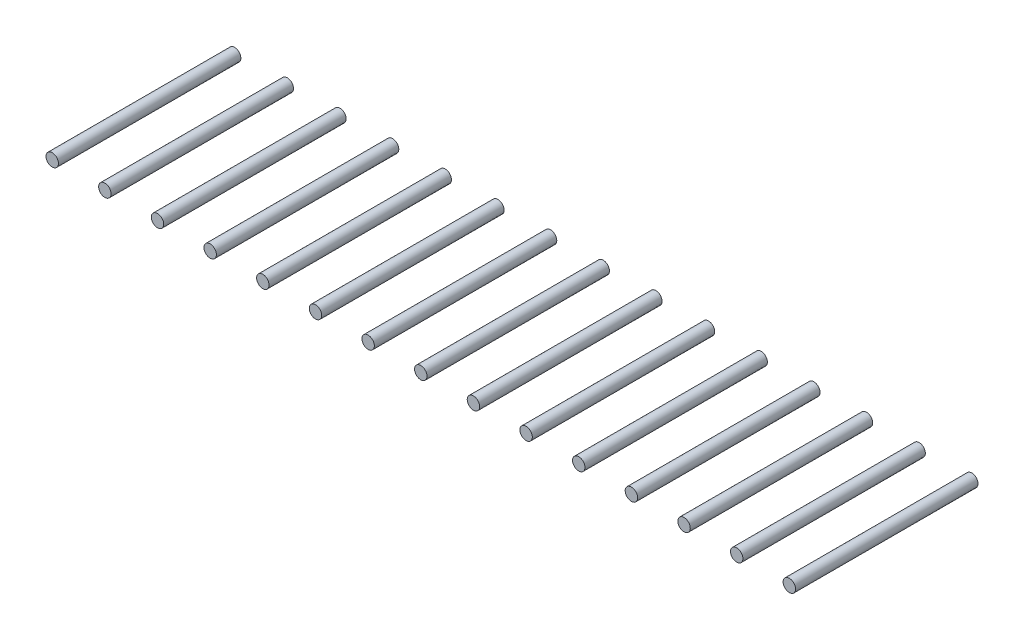
ISO-10303-21;
HEADER;
FILE_DESCRIPTION(('STEP AP214'),'2;1');
FILE_NAME('part.step','',(''),(''),'','','');
FILE_SCHEMA(('AUTOMOTIVE_DESIGN { 1 0 10303 214 1 1 1 1 }'));
ENDSEC;
DATA;
#1=APPLICATION_CONTEXT('core data for automotive mechanical design processes');
#2=APPLICATION_PROTOCOL_DEFINITION('international standard','automotive_design',2000,#1);
#3=PRODUCT_CONTEXT('',#1,'mechanical');
#4=PRODUCT('Part','Part','',(#3));
#5=PRODUCT_RELATED_PRODUCT_CATEGORY('part','',(#4));
#6=PRODUCT_DEFINITION_FORMATION('','',#4);
#7=PRODUCT_DEFINITION_CONTEXT('part definition',#1,'design');
#8=PRODUCT_DEFINITION('design','',#6,#7);
#9=PRODUCT_DEFINITION_SHAPE('','',#8);
#10=(LENGTH_UNIT() NAMED_UNIT(*) SI_UNIT(.MILLI.,.METRE.));
#11=(NAMED_UNIT(*) PLANE_ANGLE_UNIT() SI_UNIT($,.RADIAN.));
#12=(NAMED_UNIT(*) SI_UNIT($,.STERADIAN.) SOLID_ANGLE_UNIT());
#13=UNCERTAINTY_MEASURE_WITH_UNIT(LENGTH_MEASURE(1.E-05),#10,'distance_accuracy_value','');
#14=(GEOMETRIC_REPRESENTATION_CONTEXT(3) GLOBAL_UNCERTAINTY_ASSIGNED_CONTEXT((#13)) GLOBAL_UNIT_ASSIGNED_CONTEXT((#10,
#11,#12)) REPRESENTATION_CONTEXT('',''));
#15=CARTESIAN_POINT('',(0.,0.,0.));
#16=DIRECTION('',(0.,0.,1.));
#17=DIRECTION('',(1.,0.,0.));
#18=AXIS2_PLACEMENT_3D('',#15,#16,#17);
#19=CARTESIAN_POINT('',(35.56,0.,8.8));
#20=DIRECTION('',(0.,0.,-1.));
#21=DIRECTION('',(-1.,0.,0.));
#22=AXIS2_PLACEMENT_3D('',#19,#20,#21);
#23=CYLINDRICAL_SURFACE('',#22,0.299999999999997);
#24=CARTESIAN_POINT('',(35.56,0.,8.8));
#25=DIRECTION('',(0.,0.,1.));
#26=DIRECTION('',(1.,0.,0.));
#27=AXIS2_PLACEMENT_3D('',#24,#25,#26);
#28=CIRCLE('',#27,0.299999999999997);
#29=CARTESIAN_POINT('',(35.86,0.,8.8));
#30=VERTEX_POINT('',#29);
#31=EDGE_CURVE('E54',#30,#30,#28,.T.);
#32=ORIENTED_EDGE('',*,*,#31,.F.);
#33=EDGE_LOOP('',(#32));
#34=FACE_BOUND('',#33,.T.);
#35=CARTESIAN_POINT('',(35.56,0.,0.));
#36=DIRECTION('',(0.,0.,1.));
#37=DIRECTION('',(1.,0.,0.));
#38=AXIS2_PLACEMENT_3D('',#35,#36,#37);
#39=CIRCLE('',#38,0.299999999999997);
#40=CARTESIAN_POINT('',(35.86,0.,0.));
#41=VERTEX_POINT('',#40);
#42=EDGE_CURVE('E11',#41,#41,#39,.T.);
#43=ORIENTED_EDGE('',*,*,#42,.T.);
#44=EDGE_LOOP('',(#43));
#45=FACE_BOUND('',#44,.T.);
#46=ADVANCED_FACE('F50',(#34,#45),#23,.T.);
#47=CARTESIAN_POINT('',(35.56,0.,8.8));
#48=DIRECTION('',(0.,0.,1.));
#49=DIRECTION('',(1.,0.,0.));
#50=AXIS2_PLACEMENT_3D('',#47,#48,#49);
#51=PLANE('',#50);
#52=ORIENTED_EDGE('',*,*,#31,.T.);
#53=EDGE_LOOP('',(#52));
#54=FACE_BOUND('',#53,.T.);
#55=ADVANCED_FACE('F52',(#54),#51,.T.);
#56=CARTESIAN_POINT('',(35.56,0.,0.));
#57=DIRECTION('',(0.,0.,1.));
#58=DIRECTION('',(1.,0.,0.));
#59=AXIS2_PLACEMENT_3D('',#56,#57,#58);
#60=PLANE('',#59);
#61=ORIENTED_EDGE('',*,*,#42,.F.);
#62=EDGE_LOOP('',(#61));
#63=FACE_BOUND('',#62,.T.);
#64=ADVANCED_FACE('F69',(#63),#60,.F.);
#65=CLOSED_SHELL('',(#46,#55,#64));
#66=MANIFOLD_SOLID_BREP('B2',#65);
#67=CARTESIAN_POINT('',(33.02,0.,8.8));
#68=DIRECTION('',(0.,0.,-1.));
#69=DIRECTION('',(-1.,0.,0.));
#70=AXIS2_PLACEMENT_3D('',#67,#68,#69);
#71=CYLINDRICAL_SURFACE('',#70,0.299999999999997);
#72=CARTESIAN_POINT('',(33.02,0.,8.8));
#73=DIRECTION('',(0.,0.,1.));
#74=DIRECTION('',(1.,0.,0.));
#75=AXIS2_PLACEMENT_3D('',#72,#73,#74);
#76=CIRCLE('',#75,0.299999999999997);
#77=CARTESIAN_POINT('',(33.32,0.,8.8));
#78=VERTEX_POINT('',#77);
#79=EDGE_CURVE('E109',#78,#78,#76,.T.);
#80=ORIENTED_EDGE('',*,*,#79,.F.);
#81=EDGE_LOOP('',(#80));
#82=FACE_BOUND('',#81,.T.);
#83=CARTESIAN_POINT('',(33.02,0.,0.));
#84=DIRECTION('',(0.,0.,1.));
#85=DIRECTION('',(1.,0.,0.));
#86=AXIS2_PLACEMENT_3D('',#83,#84,#85);
#87=CIRCLE('',#86,0.299999999999997);
#88=CARTESIAN_POINT('',(33.32,0.,0.));
#89=VERTEX_POINT('',#88);
#90=EDGE_CURVE('E49',#89,#89,#87,.T.);
#91=ORIENTED_EDGE('',*,*,#90,.T.);
#92=EDGE_LOOP('',(#91));
#93=FACE_BOUND('',#92,.T.);
#94=ADVANCED_FACE('F105',(#82,#93),#71,.T.);
#95=CARTESIAN_POINT('',(33.02,0.,8.8));
#96=DIRECTION('',(0.,0.,1.));
#97=DIRECTION('',(1.,0.,0.));
#98=AXIS2_PLACEMENT_3D('',#95,#96,#97);
#99=PLANE('',#98);
#100=ORIENTED_EDGE('',*,*,#79,.T.);
#101=EDGE_LOOP('',(#100));
#102=FACE_BOUND('',#101,.T.);
#103=ADVANCED_FACE('F107',(#102),#99,.T.);
#104=CARTESIAN_POINT('',(33.02,0.,0.));
#105=DIRECTION('',(0.,0.,1.));
#106=DIRECTION('',(1.,0.,0.));
#107=AXIS2_PLACEMENT_3D('',#104,#105,#106);
#108=PLANE('',#107);
#109=ORIENTED_EDGE('',*,*,#90,.F.);
#110=EDGE_LOOP('',(#109));
#111=FACE_BOUND('',#110,.T.);
#112=ADVANCED_FACE('F124',(#111),#108,.F.);
#113=CLOSED_SHELL('',(#94,#103,#112));
#114=MANIFOLD_SOLID_BREP('B6',#113);
#115=CARTESIAN_POINT('',(30.48,0.,8.8));
#116=DIRECTION('',(0.,0.,-1.));
#117=DIRECTION('',(-1.,0.,0.));
#118=AXIS2_PLACEMENT_3D('',#115,#116,#117);
#119=CYLINDRICAL_SURFACE('',#118,0.3);
#120=CARTESIAN_POINT('',(30.48,0.,8.8));
#121=DIRECTION('',(0.,0.,1.));
#122=DIRECTION('',(1.,0.,0.));
#123=AXIS2_PLACEMENT_3D('',#120,#121,#122);
#124=CIRCLE('',#123,0.3);
#125=CARTESIAN_POINT('',(30.78,0.,8.8));
#126=VERTEX_POINT('',#125);
#127=EDGE_CURVE('E164',#126,#126,#124,.T.);
#128=ORIENTED_EDGE('',*,*,#127,.F.);
#129=EDGE_LOOP('',(#128));
#130=FACE_BOUND('',#129,.T.);
#131=CARTESIAN_POINT('',(30.48,0.,0.));
#132=DIRECTION('',(0.,0.,1.));
#133=DIRECTION('',(1.,0.,0.));
#134=AXIS2_PLACEMENT_3D('',#131,#132,#133);
#135=CIRCLE('',#134,0.3);
#136=CARTESIAN_POINT('',(30.78,0.,0.));
#137=VERTEX_POINT('',#136);
#138=EDGE_CURVE('E104',#137,#137,#135,.T.);
#139=ORIENTED_EDGE('',*,*,#138,.T.);
#140=EDGE_LOOP('',(#139));
#141=FACE_BOUND('',#140,.T.);
#142=ADVANCED_FACE('F160',(#130,#141),#119,.T.);
#143=CARTESIAN_POINT('',(30.48,0.,8.8));
#144=DIRECTION('',(0.,0.,1.));
#145=DIRECTION('',(1.,0.,0.));
#146=AXIS2_PLACEMENT_3D('',#143,#144,#145);
#147=PLANE('',#146);
#148=ORIENTED_EDGE('',*,*,#127,.T.);
#149=EDGE_LOOP('',(#148));
#150=FACE_BOUND('',#149,.T.);
#151=ADVANCED_FACE('F162',(#150),#147,.T.);
#152=CARTESIAN_POINT('',(30.48,0.,0.));
#153=DIRECTION('',(0.,0.,1.));
#154=DIRECTION('',(1.,0.,0.));
#155=AXIS2_PLACEMENT_3D('',#152,#153,#154);
#156=PLANE('',#155);
#157=ORIENTED_EDGE('',*,*,#138,.F.);
#158=EDGE_LOOP('',(#157));
#159=FACE_BOUND('',#158,.T.);
#160=ADVANCED_FACE('F179',(#159),#156,.F.);
#161=CLOSED_SHELL('',(#142,#151,#160));
#162=MANIFOLD_SOLID_BREP('B44',#161);
#163=CARTESIAN_POINT('',(27.94,0.,8.8));
#164=DIRECTION('',(0.,0.,-1.));
#165=DIRECTION('',(-1.,0.,0.));
#166=AXIS2_PLACEMENT_3D('',#163,#164,#165);
#167=CYLINDRICAL_SURFACE('',#166,0.3);
#168=CARTESIAN_POINT('',(27.94,0.,8.8));
#169=DIRECTION('',(0.,0.,1.));
#170=DIRECTION('',(1.,0.,0.));
#171=AXIS2_PLACEMENT_3D('',#168,#169,#170);
#172=CIRCLE('',#171,0.3);
#173=CARTESIAN_POINT('',(28.24,0.,8.8));
#174=VERTEX_POINT('',#173);
#175=EDGE_CURVE('E219',#174,#174,#172,.T.);
#176=ORIENTED_EDGE('',*,*,#175,.F.);
#177=EDGE_LOOP('',(#176));
#178=FACE_BOUND('',#177,.T.);
#179=CARTESIAN_POINT('',(27.94,0.,0.));
#180=DIRECTION('',(0.,0.,1.));
#181=DIRECTION('',(1.,0.,0.));
#182=AXIS2_PLACEMENT_3D('',#179,#180,#181);
#183=CIRCLE('',#182,0.3);
#184=CARTESIAN_POINT('',(28.24,0.,0.));
#185=VERTEX_POINT('',#184);
#186=EDGE_CURVE('E159',#185,#185,#183,.T.);
#187=ORIENTED_EDGE('',*,*,#186,.T.);
#188=EDGE_LOOP('',(#187));
#189=FACE_BOUND('',#188,.T.);
#190=ADVANCED_FACE('F215',(#178,#189),#167,.T.);
#191=CARTESIAN_POINT('',(27.94,0.,8.8));
#192=DIRECTION('',(0.,0.,1.));
#193=DIRECTION('',(1.,0.,0.));
#194=AXIS2_PLACEMENT_3D('',#191,#192,#193);
#195=PLANE('',#194);
#196=ORIENTED_EDGE('',*,*,#175,.T.);
#197=EDGE_LOOP('',(#196));
#198=FACE_BOUND('',#197,.T.);
#199=ADVANCED_FACE('F217',(#198),#195,.T.);
#200=CARTESIAN_POINT('',(27.94,0.,0.));
#201=DIRECTION('',(0.,0.,1.));
#202=DIRECTION('',(1.,0.,0.));
#203=AXIS2_PLACEMENT_3D('',#200,#201,#202);
#204=PLANE('',#203);
#205=ORIENTED_EDGE('',*,*,#186,.F.);
#206=EDGE_LOOP('',(#205));
#207=FACE_BOUND('',#206,.T.);
#208=ADVANCED_FACE('F234',(#207),#204,.F.);
#209=CLOSED_SHELL('',(#190,#199,#208));
#210=MANIFOLD_SOLID_BREP('B99',#209);
#211=CARTESIAN_POINT('',(25.4,0.,8.8));
#212=DIRECTION('',(0.,0.,-1.));
#213=DIRECTION('',(-1.,0.,0.));
#214=AXIS2_PLACEMENT_3D('',#211,#212,#213);
#215=CYLINDRICAL_SURFACE('',#214,0.3);
#216=CARTESIAN_POINT('',(25.4,0.,8.8));
#217=DIRECTION('',(0.,0.,1.));
#218=DIRECTION('',(1.,0.,0.));
#219=AXIS2_PLACEMENT_3D('',#216,#217,#218);
#220=CIRCLE('',#219,0.3);
#221=CARTESIAN_POINT('',(25.7,0.,8.8));
#222=VERTEX_POINT('',#221);
#223=EDGE_CURVE('E274',#222,#222,#220,.T.);
#224=ORIENTED_EDGE('',*,*,#223,.F.);
#225=EDGE_LOOP('',(#224));
#226=FACE_BOUND('',#225,.T.);
#227=CARTESIAN_POINT('',(25.4,0.,0.));
#228=DIRECTION('',(0.,0.,1.));
#229=DIRECTION('',(1.,0.,0.));
#230=AXIS2_PLACEMENT_3D('',#227,#228,#229);
#231=CIRCLE('',#230,0.3);
#232=CARTESIAN_POINT('',(25.7,0.,0.));
#233=VERTEX_POINT('',#232);
#234=EDGE_CURVE('E214',#233,#233,#231,.T.);
#235=ORIENTED_EDGE('',*,*,#234,.T.);
#236=EDGE_LOOP('',(#235));
#237=FACE_BOUND('',#236,.T.);
#238=ADVANCED_FACE('F270',(#226,#237),#215,.T.);
#239=CARTESIAN_POINT('',(25.4,0.,8.8));
#240=DIRECTION('',(0.,0.,1.));
#241=DIRECTION('',(1.,0.,0.));
#242=AXIS2_PLACEMENT_3D('',#239,#240,#241);
#243=PLANE('',#242);
#244=ORIENTED_EDGE('',*,*,#223,.T.);
#245=EDGE_LOOP('',(#244));
#246=FACE_BOUND('',#245,.T.);
#247=ADVANCED_FACE('F272',(#246),#243,.T.);
#248=CARTESIAN_POINT('',(25.4,0.,0.));
#249=DIRECTION('',(0.,0.,1.));
#250=DIRECTION('',(1.,0.,0.));
#251=AXIS2_PLACEMENT_3D('',#248,#249,#250);
#252=PLANE('',#251);
#253=ORIENTED_EDGE('',*,*,#234,.F.);
#254=EDGE_LOOP('',(#253));
#255=FACE_BOUND('',#254,.T.);
#256=ADVANCED_FACE('F291',(#255),#252,.F.);
#257=CLOSED_SHELL('',(#238,#247,#256));
#258=MANIFOLD_SOLID_BREP('B154',#257);
#259=CARTESIAN_POINT('',(22.86,0.,8.8));
#260=DIRECTION('',(0.,0.,-1.));
#261=DIRECTION('',(-1.,0.,0.));
#262=AXIS2_PLACEMENT_3D('',#259,#260,#261);
#263=CYLINDRICAL_SURFACE('',#262,0.3);
#264=CARTESIAN_POINT('',(22.86,0.,8.8));
#265=DIRECTION('',(0.,0.,1.));
#266=DIRECTION('',(1.,0.,0.));
#267=AXIS2_PLACEMENT_3D('',#264,#265,#266);
#268=CIRCLE('',#267,0.3);
#269=CARTESIAN_POINT('',(23.16,0.,8.8));
#270=VERTEX_POINT('',#269);
#271=EDGE_CURVE('E331',#270,#270,#268,.T.);
#272=ORIENTED_EDGE('',*,*,#271,.F.);
#273=EDGE_LOOP('',(#272));
#274=FACE_BOUND('',#273,.T.);
#275=CARTESIAN_POINT('',(22.86,0.,0.));
#276=DIRECTION('',(0.,0.,1.));
#277=DIRECTION('',(1.,0.,0.));
#278=AXIS2_PLACEMENT_3D('',#275,#276,#277);
#279=CIRCLE('',#278,0.3);
#280=CARTESIAN_POINT('',(23.16,0.,0.));
#281=VERTEX_POINT('',#280);
#282=EDGE_CURVE('E269',#281,#281,#279,.T.);
#283=ORIENTED_EDGE('',*,*,#282,.T.);
#284=EDGE_LOOP('',(#283));
#285=FACE_BOUND('',#284,.T.);
#286=ADVANCED_FACE('F327',(#274,#285),#263,.T.);
#287=CARTESIAN_POINT('',(22.86,0.,8.8));
#288=DIRECTION('',(0.,0.,1.));
#289=DIRECTION('',(1.,0.,0.));
#290=AXIS2_PLACEMENT_3D('',#287,#288,#289);
#291=PLANE('',#290);
#292=ORIENTED_EDGE('',*,*,#271,.T.);
#293=EDGE_LOOP('',(#292));
#294=FACE_BOUND('',#293,.T.);
#295=ADVANCED_FACE('F329',(#294),#291,.T.);
#296=CARTESIAN_POINT('',(22.86,0.,0.));
#297=DIRECTION('',(0.,0.,1.));
#298=DIRECTION('',(1.,0.,0.));
#299=AXIS2_PLACEMENT_3D('',#296,#297,#298);
#300=PLANE('',#299);
#301=ORIENTED_EDGE('',*,*,#282,.F.);
#302=EDGE_LOOP('',(#301));
#303=FACE_BOUND('',#302,.T.);
#304=ADVANCED_FACE('F346',(#303),#300,.F.);
#305=CLOSED_SHELL('',(#286,#295,#304));
#306=MANIFOLD_SOLID_BREP('B209',#305);
#307=CARTESIAN_POINT('',(20.32,0.,8.8));
#308=DIRECTION('',(0.,0.,-1.));
#309=DIRECTION('',(-1.,0.,0.));
#310=AXIS2_PLACEMENT_3D('',#307,#308,#309);
#311=CYLINDRICAL_SURFACE('',#310,0.3);
#312=CARTESIAN_POINT('',(20.32,0.,8.8));
#313=DIRECTION('',(0.,0.,1.));
#314=DIRECTION('',(1.,0.,0.));
#315=AXIS2_PLACEMENT_3D('',#312,#313,#314);
#316=CIRCLE('',#315,0.3);
#317=CARTESIAN_POINT('',(20.62,0.,8.8));
#318=VERTEX_POINT('',#317);
#319=EDGE_CURVE('E386',#318,#318,#316,.T.);
#320=ORIENTED_EDGE('',*,*,#319,.F.);
#321=EDGE_LOOP('',(#320));
#322=FACE_BOUND('',#321,.T.);
#323=CARTESIAN_POINT('',(20.32,0.,0.));
#324=DIRECTION('',(0.,0.,1.));
#325=DIRECTION('',(1.,0.,0.));
#326=AXIS2_PLACEMENT_3D('',#323,#324,#325);
#327=CIRCLE('',#326,0.3);
#328=CARTESIAN_POINT('',(20.62,0.,0.));
#329=VERTEX_POINT('',#328);
#330=EDGE_CURVE('E326',#329,#329,#327,.T.);
#331=ORIENTED_EDGE('',*,*,#330,.T.);
#332=EDGE_LOOP('',(#331));
#333=FACE_BOUND('',#332,.T.);
#334=ADVANCED_FACE('F382',(#322,#333),#311,.T.);
#335=CARTESIAN_POINT('',(20.32,0.,8.8));
#336=DIRECTION('',(0.,0.,1.));
#337=DIRECTION('',(1.,0.,0.));
#338=AXIS2_PLACEMENT_3D('',#335,#336,#337);
#339=PLANE('',#338);
#340=ORIENTED_EDGE('',*,*,#319,.T.);
#341=EDGE_LOOP('',(#340));
#342=FACE_BOUND('',#341,.T.);
#343=ADVANCED_FACE('F384',(#342),#339,.T.);
#344=CARTESIAN_POINT('',(20.32,0.,0.));
#345=DIRECTION('',(0.,0.,1.));
#346=DIRECTION('',(1.,0.,0.));
#347=AXIS2_PLACEMENT_3D('',#344,#345,#346);
#348=PLANE('',#347);
#349=ORIENTED_EDGE('',*,*,#330,.F.);
#350=EDGE_LOOP('',(#349));
#351=FACE_BOUND('',#350,.T.);
#352=ADVANCED_FACE('F401',(#351),#348,.F.);
#353=CLOSED_SHELL('',(#334,#343,#352));
#354=MANIFOLD_SOLID_BREP('B264',#353);
#355=CARTESIAN_POINT('',(17.78,0.,8.8));
#356=DIRECTION('',(0.,0.,-1.));
#357=DIRECTION('',(-1.,0.,0.));
#358=AXIS2_PLACEMENT_3D('',#355,#356,#357);
#359=CYLINDRICAL_SURFACE('',#358,0.3);
#360=CARTESIAN_POINT('',(17.78,0.,8.8));
#361=DIRECTION('',(0.,0.,1.));
#362=DIRECTION('',(1.,0.,0.));
#363=AXIS2_PLACEMENT_3D('',#360,#361,#362);
#364=CIRCLE('',#363,0.3);
#365=CARTESIAN_POINT('',(18.08,0.,8.8));
#366=VERTEX_POINT('',#365);
#367=EDGE_CURVE('E441',#366,#366,#364,.T.);
#368=ORIENTED_EDGE('',*,*,#367,.F.);
#369=EDGE_LOOP('',(#368));
#370=FACE_BOUND('',#369,.T.);
#371=CARTESIAN_POINT('',(17.78,0.,0.));
#372=DIRECTION('',(0.,0.,1.));
#373=DIRECTION('',(1.,0.,0.));
#374=AXIS2_PLACEMENT_3D('',#371,#372,#373);
#375=CIRCLE('',#374,0.3);
#376=CARTESIAN_POINT('',(18.08,0.,0.));
#377=VERTEX_POINT('',#376);
#378=EDGE_CURVE('E381',#377,#377,#375,.T.);
#379=ORIENTED_EDGE('',*,*,#378,.T.);
#380=EDGE_LOOP('',(#379));
#381=FACE_BOUND('',#380,.T.);
#382=ADVANCED_FACE('F437',(#370,#381),#359,.T.);
#383=CARTESIAN_POINT('',(17.78,0.,8.8));
#384=DIRECTION('',(0.,0.,1.));
#385=DIRECTION('',(1.,0.,0.));
#386=AXIS2_PLACEMENT_3D('',#383,#384,#385);
#387=PLANE('',#386);
#388=ORIENTED_EDGE('',*,*,#367,.T.);
#389=EDGE_LOOP('',(#388));
#390=FACE_BOUND('',#389,.T.);
#391=ADVANCED_FACE('F439',(#390),#387,.T.);
#392=CARTESIAN_POINT('',(17.78,0.,0.));
#393=DIRECTION('',(0.,0.,1.));
#394=DIRECTION('',(1.,0.,0.));
#395=AXIS2_PLACEMENT_3D('',#392,#393,#394);
#396=PLANE('',#395);
#397=ORIENTED_EDGE('',*,*,#378,.F.);
#398=EDGE_LOOP('',(#397));
#399=FACE_BOUND('',#398,.T.);
#400=ADVANCED_FACE('F456',(#399),#396,.F.);
#401=CLOSED_SHELL('',(#382,#391,#400));
#402=MANIFOLD_SOLID_BREP('B321',#401);
#403=CARTESIAN_POINT('',(15.24,0.,8.8));
#404=DIRECTION('',(0.,0.,-1.));
#405=DIRECTION('',(-1.,0.,0.));
#406=AXIS2_PLACEMENT_3D('',#403,#404,#405);
#407=CYLINDRICAL_SURFACE('',#406,0.3);
#408=CARTESIAN_POINT('',(15.24,0.,8.8));
#409=DIRECTION('',(0.,0.,1.));
#410=DIRECTION('',(1.,0.,0.));
#411=AXIS2_PLACEMENT_3D('',#408,#409,#410);
#412=CIRCLE('',#411,0.3);
#413=CARTESIAN_POINT('',(15.54,0.,8.8));
#414=VERTEX_POINT('',#413);
#415=EDGE_CURVE('E496',#414,#414,#412,.T.);
#416=ORIENTED_EDGE('',*,*,#415,.F.);
#417=EDGE_LOOP('',(#416));
#418=FACE_BOUND('',#417,.T.);
#419=CARTESIAN_POINT('',(15.24,0.,0.));
#420=DIRECTION('',(0.,0.,1.));
#421=DIRECTION('',(1.,0.,0.));
#422=AXIS2_PLACEMENT_3D('',#419,#420,#421);
#423=CIRCLE('',#422,0.3);
#424=CARTESIAN_POINT('',(15.54,0.,0.));
#425=VERTEX_POINT('',#424);
#426=EDGE_CURVE('E436',#425,#425,#423,.T.);
#427=ORIENTED_EDGE('',*,*,#426,.T.);
#428=EDGE_LOOP('',(#427));
#429=FACE_BOUND('',#428,.T.);
#430=ADVANCED_FACE('F492',(#418,#429),#407,.T.);
#431=CARTESIAN_POINT('',(15.24,0.,8.8));
#432=DIRECTION('',(0.,0.,1.));
#433=DIRECTION('',(1.,0.,0.));
#434=AXIS2_PLACEMENT_3D('',#431,#432,#433);
#435=PLANE('',#434);
#436=ORIENTED_EDGE('',*,*,#415,.T.);
#437=EDGE_LOOP('',(#436));
#438=FACE_BOUND('',#437,.T.);
#439=ADVANCED_FACE('F494',(#438),#435,.T.);
#440=CARTESIAN_POINT('',(15.24,0.,0.));
#441=DIRECTION('',(0.,0.,1.));
#442=DIRECTION('',(1.,0.,0.));
#443=AXIS2_PLACEMENT_3D('',#440,#441,#442);
#444=PLANE('',#443);
#445=ORIENTED_EDGE('',*,*,#426,.F.);
#446=EDGE_LOOP('',(#445));
#447=FACE_BOUND('',#446,.T.);
#448=ADVANCED_FACE('F511',(#447),#444,.F.);
#449=CLOSED_SHELL('',(#430,#439,#448));
#450=MANIFOLD_SOLID_BREP('B376',#449);
#451=CARTESIAN_POINT('',(12.7,0.,8.8));
#452=DIRECTION('',(0.,0.,-1.));
#453=DIRECTION('',(-1.,0.,0.));
#454=AXIS2_PLACEMENT_3D('',#451,#452,#453);
#455=CYLINDRICAL_SURFACE('',#454,0.3);
#456=CARTESIAN_POINT('',(12.7,0.,8.8));
#457=DIRECTION('',(0.,0.,1.));
#458=DIRECTION('',(1.,0.,0.));
#459=AXIS2_PLACEMENT_3D('',#456,#457,#458);
#460=CIRCLE('',#459,0.3);
#461=CARTESIAN_POINT('',(13.,0.,8.8));
#462=VERTEX_POINT('',#461);
#463=EDGE_CURVE('E551',#462,#462,#460,.T.);
#464=ORIENTED_EDGE('',*,*,#463,.F.);
#465=EDGE_LOOP('',(#464));
#466=FACE_BOUND('',#465,.T.);
#467=CARTESIAN_POINT('',(12.7,0.,0.));
#468=DIRECTION('',(0.,0.,1.));
#469=DIRECTION('',(1.,0.,0.));
#470=AXIS2_PLACEMENT_3D('',#467,#468,#469);
#471=CIRCLE('',#470,0.3);
#472=CARTESIAN_POINT('',(13.,0.,0.));
#473=VERTEX_POINT('',#472);
#474=EDGE_CURVE('E491',#473,#473,#471,.T.);
#475=ORIENTED_EDGE('',*,*,#474,.T.);
#476=EDGE_LOOP('',(#475));
#477=FACE_BOUND('',#476,.T.);
#478=ADVANCED_FACE('F547',(#466,#477),#455,.T.);
#479=CARTESIAN_POINT('',(12.7,0.,8.8));
#480=DIRECTION('',(0.,0.,1.));
#481=DIRECTION('',(1.,0.,0.));
#482=AXIS2_PLACEMENT_3D('',#479,#480,#481);
#483=PLANE('',#482);
#484=ORIENTED_EDGE('',*,*,#463,.T.);
#485=EDGE_LOOP('',(#484));
#486=FACE_BOUND('',#485,.T.);
#487=ADVANCED_FACE('F549',(#486),#483,.T.);
#488=CARTESIAN_POINT('',(12.7,0.,0.));
#489=DIRECTION('',(0.,0.,1.));
#490=DIRECTION('',(1.,0.,0.));
#491=AXIS2_PLACEMENT_3D('',#488,#489,#490);
#492=PLANE('',#491);
#493=ORIENTED_EDGE('',*,*,#474,.F.);
#494=EDGE_LOOP('',(#493));
#495=FACE_BOUND('',#494,.T.);
#496=ADVANCED_FACE('F566',(#495),#492,.F.);
#497=CLOSED_SHELL('',(#478,#487,#496));
#498=MANIFOLD_SOLID_BREP('B431',#497);
#499=CARTESIAN_POINT('',(10.16,0.,8.8));
#500=DIRECTION('',(0.,0.,-1.));
#501=DIRECTION('',(-1.,0.,0.));
#502=AXIS2_PLACEMENT_3D('',#499,#500,#501);
#503=CYLINDRICAL_SURFACE('',#502,0.3);
#504=CARTESIAN_POINT('',(10.16,0.,8.8));
#505=DIRECTION('',(0.,0.,1.));
#506=DIRECTION('',(1.,0.,0.));
#507=AXIS2_PLACEMENT_3D('',#504,#505,#506);
#508=CIRCLE('',#507,0.3);
#509=CARTESIAN_POINT('',(10.46,0.,8.8));
#510=VERTEX_POINT('',#509);
#511=EDGE_CURVE('E606',#510,#510,#508,.T.);
#512=ORIENTED_EDGE('',*,*,#511,.F.);
#513=EDGE_LOOP('',(#512));
#514=FACE_BOUND('',#513,.T.);
#515=CARTESIAN_POINT('',(10.16,0.,0.));
#516=DIRECTION('',(0.,0.,1.));
#517=DIRECTION('',(1.,0.,0.));
#518=AXIS2_PLACEMENT_3D('',#515,#516,#517);
#519=CIRCLE('',#518,0.3);
#520=CARTESIAN_POINT('',(10.46,0.,0.));
#521=VERTEX_POINT('',#520);
#522=EDGE_CURVE('E546',#521,#521,#519,.T.);
#523=ORIENTED_EDGE('',*,*,#522,.T.);
#524=EDGE_LOOP('',(#523));
#525=FACE_BOUND('',#524,.T.);
#526=ADVANCED_FACE('F602',(#514,#525),#503,.T.);
#527=CARTESIAN_POINT('',(10.16,0.,8.8));
#528=DIRECTION('',(0.,0.,1.));
#529=DIRECTION('',(1.,0.,0.));
#530=AXIS2_PLACEMENT_3D('',#527,#528,#529);
#531=PLANE('',#530);
#532=ORIENTED_EDGE('',*,*,#511,.T.);
#533=EDGE_LOOP('',(#532));
#534=FACE_BOUND('',#533,.T.);
#535=ADVANCED_FACE('F604',(#534),#531,.T.);
#536=CARTESIAN_POINT('',(10.16,0.,0.));
#537=DIRECTION('',(0.,0.,1.));
#538=DIRECTION('',(1.,0.,0.));
#539=AXIS2_PLACEMENT_3D('',#536,#537,#538);
#540=PLANE('',#539);
#541=ORIENTED_EDGE('',*,*,#522,.F.);
#542=EDGE_LOOP('',(#541));
#543=FACE_BOUND('',#542,.T.);
#544=ADVANCED_FACE('F621',(#543),#540,.F.);
#545=CLOSED_SHELL('',(#526,#535,#544));
#546=MANIFOLD_SOLID_BREP('B486',#545);
#547=CARTESIAN_POINT('',(7.62,0.,8.8));
#548=DIRECTION('',(0.,0.,-1.));
#549=DIRECTION('',(-1.,0.,0.));
#550=AXIS2_PLACEMENT_3D('',#547,#548,#549);
#551=CYLINDRICAL_SURFACE('',#550,0.3);
#552=CARTESIAN_POINT('',(7.62,0.,8.8));
#553=DIRECTION('',(0.,0.,1.));
#554=DIRECTION('',(1.,0.,0.));
#555=AXIS2_PLACEMENT_3D('',#552,#553,#554);
#556=CIRCLE('',#555,0.3);
#557=CARTESIAN_POINT('',(7.92,0.,8.8));
#558=VERTEX_POINT('',#557);
#559=EDGE_CURVE('E661',#558,#558,#556,.T.);
#560=ORIENTED_EDGE('',*,*,#559,.F.);
#561=EDGE_LOOP('',(#560));
#562=FACE_BOUND('',#561,.T.);
#563=CARTESIAN_POINT('',(7.62,0.,0.));
#564=DIRECTION('',(0.,0.,1.));
#565=DIRECTION('',(1.,0.,0.));
#566=AXIS2_PLACEMENT_3D('',#563,#564,#565);
#567=CIRCLE('',#566,0.3);
#568=CARTESIAN_POINT('',(7.92,0.,0.));
#569=VERTEX_POINT('',#568);
#570=EDGE_CURVE('E601',#569,#569,#567,.T.);
#571=ORIENTED_EDGE('',*,*,#570,.T.);
#572=EDGE_LOOP('',(#571));
#573=FACE_BOUND('',#572,.T.);
#574=ADVANCED_FACE('F657',(#562,#573),#551,.T.);
#575=CARTESIAN_POINT('',(7.62,0.,8.8));
#576=DIRECTION('',(0.,0.,1.));
#577=DIRECTION('',(1.,0.,0.));
#578=AXIS2_PLACEMENT_3D('',#575,#576,#577);
#579=PLANE('',#578);
#580=ORIENTED_EDGE('',*,*,#559,.T.);
#581=EDGE_LOOP('',(#580));
#582=FACE_BOUND('',#581,.T.);
#583=ADVANCED_FACE('F659',(#582),#579,.T.);
#584=CARTESIAN_POINT('',(7.62,0.,0.));
#585=DIRECTION('',(0.,0.,1.));
#586=DIRECTION('',(1.,0.,0.));
#587=AXIS2_PLACEMENT_3D('',#584,#585,#586);
#588=PLANE('',#587);
#589=ORIENTED_EDGE('',*,*,#570,.F.);
#590=EDGE_LOOP('',(#589));
#591=FACE_BOUND('',#590,.T.);
#592=ADVANCED_FACE('F676',(#591),#588,.F.);
#593=CLOSED_SHELL('',(#574,#583,#592));
#594=MANIFOLD_SOLID_BREP('B541',#593);
#595=CARTESIAN_POINT('',(5.08,0.,8.8));
#596=DIRECTION('',(0.,0.,-1.));
#597=DIRECTION('',(-1.,0.,0.));
#598=AXIS2_PLACEMENT_3D('',#595,#596,#597);
#599=CYLINDRICAL_SURFACE('',#598,0.3);
#600=CARTESIAN_POINT('',(5.08,0.,8.8));
#601=DIRECTION('',(0.,0.,1.));
#602=DIRECTION('',(1.,0.,0.));
#603=AXIS2_PLACEMENT_3D('',#600,#601,#602);
#604=CIRCLE('',#603,0.3);
#605=CARTESIAN_POINT('',(5.38,0.,8.8));
#606=VERTEX_POINT('',#605);
#607=EDGE_CURVE('E716',#606,#606,#604,.T.);
#608=ORIENTED_EDGE('',*,*,#607,.F.);
#609=EDGE_LOOP('',(#608));
#610=FACE_BOUND('',#609,.T.);
#611=CARTESIAN_POINT('',(5.08,0.,0.));
#612=DIRECTION('',(0.,0.,1.));
#613=DIRECTION('',(1.,0.,0.));
#614=AXIS2_PLACEMENT_3D('',#611,#612,#613);
#615=CIRCLE('',#614,0.3);
#616=CARTESIAN_POINT('',(5.38,0.,0.));
#617=VERTEX_POINT('',#616);
#618=EDGE_CURVE('E656',#617,#617,#615,.T.);
#619=ORIENTED_EDGE('',*,*,#618,.T.);
#620=EDGE_LOOP('',(#619));
#621=FACE_BOUND('',#620,.T.);
#622=ADVANCED_FACE('F712',(#610,#621),#599,.T.);
#623=CARTESIAN_POINT('',(5.08,0.,8.8));
#624=DIRECTION('',(0.,0.,1.));
#625=DIRECTION('',(1.,0.,0.));
#626=AXIS2_PLACEMENT_3D('',#623,#624,#625);
#627=PLANE('',#626);
#628=ORIENTED_EDGE('',*,*,#607,.T.);
#629=EDGE_LOOP('',(#628));
#630=FACE_BOUND('',#629,.T.);
#631=ADVANCED_FACE('F714',(#630),#627,.T.);
#632=CARTESIAN_POINT('',(5.08,0.,0.));
#633=DIRECTION('',(0.,0.,1.));
#634=DIRECTION('',(1.,0.,0.));
#635=AXIS2_PLACEMENT_3D('',#632,#633,#634);
#636=PLANE('',#635);
#637=ORIENTED_EDGE('',*,*,#618,.F.);
#638=EDGE_LOOP('',(#637));
#639=FACE_BOUND('',#638,.T.);
#640=ADVANCED_FACE('F731',(#639),#636,.F.);
#641=CLOSED_SHELL('',(#622,#631,#640));
#642=MANIFOLD_SOLID_BREP('B596',#641);
#643=CARTESIAN_POINT('',(2.54,0.,8.8));
#644=DIRECTION('',(0.,0.,-1.));
#645=DIRECTION('',(-1.,0.,0.));
#646=AXIS2_PLACEMENT_3D('',#643,#644,#645);
#647=CYLINDRICAL_SURFACE('',#646,0.3);
#648=CARTESIAN_POINT('',(2.54,0.,8.8));
#649=DIRECTION('',(0.,0.,1.));
#650=DIRECTION('',(1.,0.,0.));
#651=AXIS2_PLACEMENT_3D('',#648,#649,#650);
#652=CIRCLE('',#651,0.3);
#653=CARTESIAN_POINT('',(2.84,0.,8.8));
#654=VERTEX_POINT('',#653);
#655=EDGE_CURVE('E770',#654,#654,#652,.T.);
#656=ORIENTED_EDGE('',*,*,#655,.F.);
#657=EDGE_LOOP('',(#656));
#658=FACE_BOUND('',#657,.T.);
#659=CARTESIAN_POINT('',(2.54,0.,0.));
#660=DIRECTION('',(0.,0.,1.));
#661=DIRECTION('',(1.,0.,0.));
#662=AXIS2_PLACEMENT_3D('',#659,#660,#661);
#663=CIRCLE('',#662,0.3);
#664=CARTESIAN_POINT('',(2.84,0.,0.));
#665=VERTEX_POINT('',#664);
#666=EDGE_CURVE('E711',#665,#665,#663,.T.);
#667=ORIENTED_EDGE('',*,*,#666,.T.);
#668=EDGE_LOOP('',(#667));
#669=FACE_BOUND('',#668,.T.);
#670=ADVANCED_FACE('F766',(#658,#669),#647,.T.);
#671=CARTESIAN_POINT('',(2.54,0.,8.8));
#672=DIRECTION('',(0.,0.,1.));
#673=DIRECTION('',(1.,0.,0.));
#674=AXIS2_PLACEMENT_3D('',#671,#672,#673);
#675=PLANE('',#674);
#676=ORIENTED_EDGE('',*,*,#655,.T.);
#677=EDGE_LOOP('',(#676));
#678=FACE_BOUND('',#677,.T.);
#679=ADVANCED_FACE('F768',(#678),#675,.T.);
#680=CARTESIAN_POINT('',(2.54,0.,0.));
#681=DIRECTION('',(0.,0.,1.));
#682=DIRECTION('',(1.,0.,0.));
#683=AXIS2_PLACEMENT_3D('',#680,#681,#682);
#684=PLANE('',#683);
#685=ORIENTED_EDGE('',*,*,#666,.F.);
#686=EDGE_LOOP('',(#685));
#687=FACE_BOUND('',#686,.T.);
#688=ADVANCED_FACE('F785',(#687),#684,.F.);
#689=CLOSED_SHELL('',(#670,#679,#688));
#690=MANIFOLD_SOLID_BREP('B651',#689);
#691=CARTESIAN_POINT('',(0.,0.,8.8));
#692=DIRECTION('',(0.,0.,-1.));
#693=DIRECTION('',(-1.,0.,0.));
#694=AXIS2_PLACEMENT_3D('',#691,#692,#693);
#695=CYLINDRICAL_SURFACE('',#694,0.3);
#696=CARTESIAN_POINT('',(0.,0.,8.8));
#697=DIRECTION('',(0.,0.,1.));
#698=DIRECTION('',(1.,0.,0.));
#699=AXIS2_PLACEMENT_3D('',#696,#697,#698);
#700=CIRCLE('',#699,0.3);
#701=CARTESIAN_POINT('',(0.3,0.,8.8));
#702=VERTEX_POINT('',#701);
#703=EDGE_CURVE('E765',#702,#702,#700,.T.);
#704=ORIENTED_EDGE('',*,*,#703,.F.);
#705=EDGE_LOOP('',(#704));
#706=FACE_BOUND('',#705,.T.);
#707=CARTESIAN_POINT('',(0.,0.,0.));
#708=DIRECTION('',(0.,0.,1.));
#709=DIRECTION('',(1.,0.,0.));
#710=AXIS2_PLACEMENT_3D('',#707,#708,#709);
#711=CIRCLE('',#710,0.3);
#712=CARTESIAN_POINT('',(0.3,0.,0.));
#713=VERTEX_POINT('',#712);
#714=EDGE_CURVE('E816',#713,#713,#711,.T.);
#715=ORIENTED_EDGE('',*,*,#714,.T.);
#716=EDGE_LOOP('',(#715));
#717=FACE_BOUND('',#716,.T.);
#718=ADVANCED_FACE('F813',(#706,#717),#695,.T.);
#719=CARTESIAN_POINT('',(0.,0.,8.8));
#720=DIRECTION('',(0.,0.,1.));
#721=DIRECTION('',(1.,0.,0.));
#722=AXIS2_PLACEMENT_3D('',#719,#720,#721);
#723=PLANE('',#722);
#724=ORIENTED_EDGE('',*,*,#703,.T.);
#725=EDGE_LOOP('',(#724));
#726=FACE_BOUND('',#725,.T.);
#727=ADVANCED_FACE('F828',(#726),#723,.T.);
#728=CARTESIAN_POINT('',(0.,0.,0.));
#729=DIRECTION('',(0.,0.,1.));
#730=DIRECTION('',(1.,0.,0.));
#731=AXIS2_PLACEMENT_3D('',#728,#729,#730);
#732=PLANE('',#731);
#733=ORIENTED_EDGE('',*,*,#714,.F.);
#734=EDGE_LOOP('',(#733));
#735=FACE_BOUND('',#734,.T.);
#736=ADVANCED_FACE('F826',(#735),#732,.F.);
#737=CLOSED_SHELL('',(#718,#727,#736));
#738=MANIFOLD_SOLID_BREP('B706',#737);
#739=ADVANCED_BREP_SHAPE_REPRESENTATION('',(#18,#66,#114,#162,#210,#258,#306,#354,#402,#450,
#498,#546,#594,#642,#690,#738),#14);
#740=SHAPE_DEFINITION_REPRESENTATION(#9,#739);
ENDSEC;
END-ISO-10303-21;
